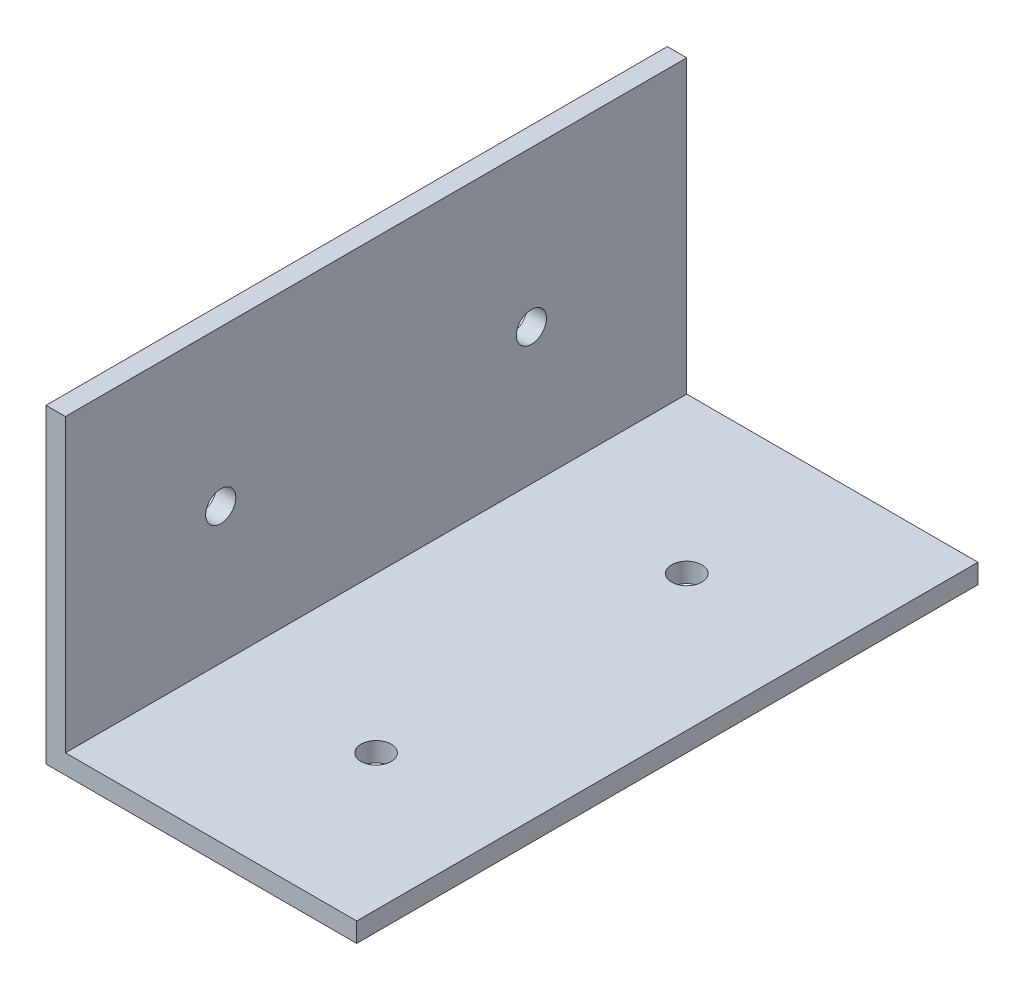
ISO-10303-21;
HEADER;
FILE_DESCRIPTION(('STEP AP214'),'2;1');
FILE_NAME('part.step','',(''),(''),'','','');
FILE_SCHEMA(('AUTOMOTIVE_DESIGN { 1 0 10303 214 1 1 1 1 }'));
ENDSEC;
DATA;
#1=APPLICATION_CONTEXT('core data for automotive mechanical design processes');
#2=APPLICATION_PROTOCOL_DEFINITION('international standard','automotive_design',2000,#1);
#3=PRODUCT_CONTEXT('',#1,'mechanical');
#4=PRODUCT('Part','Part','',(#3));
#5=PRODUCT_RELATED_PRODUCT_CATEGORY('part','',(#4));
#6=PRODUCT_DEFINITION_FORMATION('','',#4);
#7=PRODUCT_DEFINITION_CONTEXT('part definition',#1,'design');
#8=PRODUCT_DEFINITION('design','',#6,#7);
#9=PRODUCT_DEFINITION_SHAPE('','',#8);
#10=(LENGTH_UNIT() NAMED_UNIT(*) SI_UNIT(.MILLI.,.METRE.));
#11=(NAMED_UNIT(*) PLANE_ANGLE_UNIT() SI_UNIT($,.RADIAN.));
#12=(NAMED_UNIT(*) SI_UNIT($,.STERADIAN.) SOLID_ANGLE_UNIT());
#13=UNCERTAINTY_MEASURE_WITH_UNIT(LENGTH_MEASURE(1.E-05),#10,'distance_accuracy_value','');
#14=(GEOMETRIC_REPRESENTATION_CONTEXT(3) GLOBAL_UNCERTAINTY_ASSIGNED_CONTEXT((#13)) GLOBAL_UNIT_ASSIGNED_CONTEXT((#10,
#11,#12)) REPRESENTATION_CONTEXT('',''));
#15=CARTESIAN_POINT('',(0.,0.,0.));
#16=DIRECTION('',(0.,0.,1.));
#17=DIRECTION('',(1.,0.,0.));
#18=AXIS2_PLACEMENT_3D('',#15,#16,#17);
#19=CARTESIAN_POINT('',(0.,0.,101.6));
#20=DIRECTION('',(0.,-1.,0.));
#21=DIRECTION('',(0.,0.,-1.));
#22=AXIS2_PLACEMENT_3D('',#19,#20,#21);
#23=PLANE('',#22);
#24=CARTESIAN_POINT('',(25.4,0.,76.2));
#25=DIRECTION('',(0.,1.,0.));
#26=DIRECTION('',(0.,0.,1.));
#27=AXIS2_PLACEMENT_3D('',#24,#25,#26);
#28=CIRCLE('',#27,2.46379999999999);
#29=CARTESIAN_POINT('',(25.4,0.,78.6638));
#30=VERTEX_POINT('',#29);
#31=EDGE_CURVE('E160',#30,#30,#28,.T.);
#32=ORIENTED_EDGE('',*,*,#31,.F.);
#33=EDGE_LOOP('',(#32));
#34=FACE_BOUND('',#33,.T.);
#35=CARTESIAN_POINT('',(25.4,0.,25.4));
#36=DIRECTION('',(0.,1.,0.));
#37=DIRECTION('',(0.,0.,1.));
#38=AXIS2_PLACEMENT_3D('',#35,#36,#37);
#39=CIRCLE('',#38,2.4638);
#40=CARTESIAN_POINT('',(25.4,0.,27.8638));
#41=VERTEX_POINT('',#40);
#42=EDGE_CURVE('E172',#41,#41,#39,.T.);
#43=ORIENTED_EDGE('',*,*,#42,.F.);
#44=EDGE_LOOP('',(#43));
#45=FACE_BOUND('',#44,.T.);
#46=DIRECTION('',(-1.,0.,0.));
#47=VECTOR('',#46,1.);
#48=CARTESIAN_POINT('',(0.,0.,0.));
#49=LINE('',#48,#47);
#50=CARTESIAN_POINT('',(47.625,0.,0.));
#51=VERTEX_POINT('',#50);
#52=CARTESIAN_POINT('',(0.,0.,0.));
#53=VERTEX_POINT('',#52);
#54=EDGE_CURVE('E129',#51,#53,#49,.T.);
#55=ORIENTED_EDGE('',*,*,#54,.T.);
#56=DIRECTION('',(0.,0.,-1.));
#57=VECTOR('',#56,1.);
#58=CARTESIAN_POINT('',(0.,0.,101.6));
#59=LINE('',#58,#57);
#60=CARTESIAN_POINT('',(0.,0.,101.6));
#61=VERTEX_POINT('',#60);
#62=EDGE_CURVE('E11',#61,#53,#59,.T.);
#63=ORIENTED_EDGE('',*,*,#62,.F.);
#64=DIRECTION('',(-1.,0.,0.));
#65=VECTOR('',#64,1.);
#66=CARTESIAN_POINT('',(0.,0.,101.6));
#67=LINE('',#66,#65);
#68=CARTESIAN_POINT('',(47.625,0.,101.6));
#69=VERTEX_POINT('',#68);
#70=EDGE_CURVE('E146',#69,#61,#67,.T.);
#71=ORIENTED_EDGE('',*,*,#70,.F.);
#72=DIRECTION('',(0.,0.,-1.));
#73=VECTOR('',#72,1.);
#74=CARTESIAN_POINT('',(47.625,0.,101.6));
#75=LINE('',#74,#73);
#76=EDGE_CURVE('E125',#69,#51,#75,.T.);
#77=ORIENTED_EDGE('',*,*,#76,.T.);
#78=EDGE_LOOP('',(#55,#63,#71,#77));
#79=FACE_BOUND('',#78,.T.);
#80=ADVANCED_FACE('F38',(#34,#45,#79),#23,.F.);
#81=CARTESIAN_POINT('',(0.,0.,101.6));
#82=DIRECTION('',(-1.,0.,0.));
#83=DIRECTION('',(0.,0.,1.));
#84=AXIS2_PLACEMENT_3D('',#81,#82,#83);
#85=PLANE('',#84);
#86=CARTESIAN_POINT('',(0.,22.225,25.4));
#87=DIRECTION('',(1.,0.,0.));
#88=DIRECTION('',(0.,0.,-1.));
#89=AXIS2_PLACEMENT_3D('',#86,#87,#88);
#90=CIRCLE('',#89,2.4638);
#91=CARTESIAN_POINT('',(0.,22.225,22.9362));
#92=VERTEX_POINT('',#91);
#93=EDGE_CURVE('E166',#92,#92,#90,.T.);
#94=ORIENTED_EDGE('',*,*,#93,.F.);
#95=EDGE_LOOP('',(#94));
#96=FACE_BOUND('',#95,.T.);
#97=CARTESIAN_POINT('',(0.,22.225,76.2));
#98=DIRECTION('',(1.,0.,0.));
#99=DIRECTION('',(0.,0.,-1.));
#100=AXIS2_PLACEMENT_3D('',#97,#98,#99);
#101=CIRCLE('',#100,2.4638);
#102=CARTESIAN_POINT('',(0.,22.225,73.7362));
#103=VERTEX_POINT('',#102);
#104=EDGE_CURVE('E174',#103,#103,#101,.T.);
#105=ORIENTED_EDGE('',*,*,#104,.F.);
#106=EDGE_LOOP('',(#105));
#107=FACE_BOUND('',#106,.T.);
#108=DIRECTION('',(0.,1.,0.));
#109=VECTOR('',#108,1.);
#110=CARTESIAN_POINT('',(0.,0.,0.));
#111=LINE('',#110,#109);
#112=CARTESIAN_POINT('',(0.,47.625,0.));
#113=VERTEX_POINT('',#112);
#114=EDGE_CURVE('E133',#53,#113,#111,.T.);
#115=ORIENTED_EDGE('',*,*,#114,.T.);
#116=DIRECTION('',(0.,0.,-1.));
#117=VECTOR('',#116,1.);
#118=CARTESIAN_POINT('',(0.,47.625,101.6));
#119=LINE('',#118,#117);
#120=CARTESIAN_POINT('',(0.,47.625,101.6));
#121=VERTEX_POINT('',#120);
#122=EDGE_CURVE('E48',#121,#113,#119,.T.);
#123=ORIENTED_EDGE('',*,*,#122,.F.);
#124=DIRECTION('',(0.,1.,0.));
#125=VECTOR('',#124,1.);
#126=CARTESIAN_POINT('',(0.,0.,101.6));
#127=LINE('',#126,#125);
#128=EDGE_CURVE('E94',#61,#121,#127,.T.);
#129=ORIENTED_EDGE('',*,*,#128,.F.);
#130=ORIENTED_EDGE('',*,*,#62,.T.);
#131=EDGE_LOOP('',(#115,#123,#129,#130));
#132=FACE_BOUND('',#131,.T.);
#133=ADVANCED_FACE('F194',(#96,#107,#132),#85,.F.);
#134=CARTESIAN_POINT('',(0.,47.625,101.6));
#135=DIRECTION('',(0.,-1.,0.));
#136=DIRECTION('',(0.,0.,-1.));
#137=AXIS2_PLACEMENT_3D('',#134,#135,#136);
#138=PLANE('',#137);
#139=DIRECTION('',(-1.,0.,0.));
#140=VECTOR('',#139,1.);
#141=CARTESIAN_POINT('',(0.,47.625,0.));
#142=LINE('',#141,#140);
#143=CARTESIAN_POINT('',(-3.175,47.625,0.));
#144=VERTEX_POINT('',#143);
#145=EDGE_CURVE('E137',#113,#144,#142,.T.);
#146=ORIENTED_EDGE('',*,*,#145,.T.);
#147=DIRECTION('',(0.,0.,-1.));
#148=VECTOR('',#147,1.);
#149=CARTESIAN_POINT('',(-3.175,47.625,101.6));
#150=LINE('',#149,#148);
#151=CARTESIAN_POINT('',(-3.175,47.625,101.6));
#152=VERTEX_POINT('',#151);
#153=EDGE_CURVE('E118',#152,#144,#150,.T.);
#154=ORIENTED_EDGE('',*,*,#153,.F.);
#155=DIRECTION('',(-1.,0.,0.));
#156=VECTOR('',#155,1.);
#157=CARTESIAN_POINT('',(0.,47.625,101.6));
#158=LINE('',#157,#156);
#159=EDGE_CURVE('E107',#121,#152,#158,.T.);
#160=ORIENTED_EDGE('',*,*,#159,.F.);
#161=ORIENTED_EDGE('',*,*,#122,.T.);
#162=EDGE_LOOP('',(#146,#154,#160,#161));
#163=FACE_BOUND('',#162,.T.);
#164=ADVANCED_FACE('F197',(#163),#138,.F.);
#165=CARTESIAN_POINT('',(-3.175,47.625,101.6));
#166=DIRECTION('',(1.,0.,0.));
#167=DIRECTION('',(0.,1.,0.));
#168=AXIS2_PLACEMENT_3D('',#165,#166,#167);
#169=PLANE('',#168);
#170=CARTESIAN_POINT('',(-3.175,22.225,25.4));
#171=DIRECTION('',(1.,0.,0.));
#172=DIRECTION('',(0.,1.,0.));
#173=AXIS2_PLACEMENT_3D('',#170,#171,#172);
#174=CIRCLE('',#173,2.4638);
#175=CARTESIAN_POINT('',(-3.175,24.6888,25.4));
#176=VERTEX_POINT('',#175);
#177=EDGE_CURVE('E41',#176,#176,#174,.T.);
#178=ORIENTED_EDGE('',*,*,#177,.T.);
#179=EDGE_LOOP('',(#178));
#180=FACE_BOUND('',#179,.T.);
#181=CARTESIAN_POINT('',(-3.175,22.225,76.2));
#182=DIRECTION('',(1.,0.,0.));
#183=DIRECTION('',(0.,1.,0.));
#184=AXIS2_PLACEMENT_3D('',#181,#182,#183);
#185=CIRCLE('',#184,2.4638);
#186=CARTESIAN_POINT('',(-3.175,24.6888,76.2));
#187=VERTEX_POINT('',#186);
#188=EDGE_CURVE('E163',#187,#187,#185,.T.);
#189=ORIENTED_EDGE('',*,*,#188,.T.);
#190=EDGE_LOOP('',(#189));
#191=FACE_BOUND('',#190,.T.);
#192=DIRECTION('',(0.,-1.,0.));
#193=VECTOR('',#192,1.);
#194=CARTESIAN_POINT('',(-3.175,47.625,0.));
#195=LINE('',#194,#193);
#196=CARTESIAN_POINT('',(-3.17499999999999,-3.175,0.));
#197=VERTEX_POINT('',#196);
#198=EDGE_CURVE('E116',#144,#197,#195,.T.);
#199=ORIENTED_EDGE('',*,*,#198,.T.);
#200=DIRECTION('',(0.,0.,-1.));
#201=VECTOR('',#200,1.);
#202=CARTESIAN_POINT('',(-3.17499999999999,-3.175,101.6));
#203=LINE('',#202,#201);
#204=CARTESIAN_POINT('',(-3.17499999999999,-3.175,101.6));
#205=VERTEX_POINT('',#204);
#206=EDGE_CURVE('E113',#205,#197,#203,.T.);
#207=ORIENTED_EDGE('',*,*,#206,.F.);
#208=DIRECTION('',(0.,-1.,0.));
#209=VECTOR('',#208,1.);
#210=CARTESIAN_POINT('',(-3.175,47.625,101.6));
#211=LINE('',#210,#209);
#212=EDGE_CURVE('E101',#152,#205,#211,.T.);
#213=ORIENTED_EDGE('',*,*,#212,.F.);
#214=ORIENTED_EDGE('',*,*,#153,.T.);
#215=EDGE_LOOP('',(#199,#207,#213,#214));
#216=FACE_BOUND('',#215,.T.);
#217=ADVANCED_FACE('F114',(#180,#191,#216),#169,.F.);
#218=CARTESIAN_POINT('',(-3.17499999999999,-3.175,101.6));
#219=DIRECTION('',(0.,1.,0.));
#220=DIRECTION('',(0.,0.,1.));
#221=AXIS2_PLACEMENT_3D('',#218,#219,#220);
#222=PLANE('',#221);
#223=CARTESIAN_POINT('',(25.4,-3.175,76.2));
#224=DIRECTION('',(0.,1.,0.));
#225=DIRECTION('',(0.,0.,1.));
#226=AXIS2_PLACEMENT_3D('',#223,#224,#225);
#227=CIRCLE('',#226,2.46379999999999);
#228=CARTESIAN_POINT('',(25.4,-3.175,78.6638));
#229=VERTEX_POINT('',#228);
#230=EDGE_CURVE('E134',#229,#229,#227,.T.);
#231=ORIENTED_EDGE('',*,*,#230,.T.);
#232=EDGE_LOOP('',(#231));
#233=FACE_BOUND('',#232,.T.);
#234=CARTESIAN_POINT('',(25.4,-3.175,25.4));
#235=DIRECTION('',(0.,1.,0.));
#236=DIRECTION('',(0.,0.,1.));
#237=AXIS2_PLACEMENT_3D('',#234,#235,#236);
#238=CIRCLE('',#237,2.4638);
#239=CARTESIAN_POINT('',(25.4,-3.175,27.8638));
#240=VERTEX_POINT('',#239);
#241=EDGE_CURVE('E156',#240,#240,#238,.T.);
#242=ORIENTED_EDGE('',*,*,#241,.T.);
#243=EDGE_LOOP('',(#242));
#244=FACE_BOUND('',#243,.T.);
#245=DIRECTION('',(1.,0.,0.));
#246=VECTOR('',#245,1.);
#247=CARTESIAN_POINT('',(-3.17499999999999,-3.175,0.));
#248=LINE('',#247,#246);
#249=CARTESIAN_POINT('',(47.625,-3.175,0.));
#250=VERTEX_POINT('',#249);
#251=EDGE_CURVE('E80',#197,#250,#248,.T.);
#252=ORIENTED_EDGE('',*,*,#251,.T.);
#253=DIRECTION('',(0.,0.,-1.));
#254=VECTOR('',#253,1.);
#255=CARTESIAN_POINT('',(47.625,-3.175,101.6));
#256=LINE('',#255,#254);
#257=CARTESIAN_POINT('',(47.625,-3.175,101.6));
#258=VERTEX_POINT('',#257);
#259=EDGE_CURVE('E119',#258,#250,#256,.T.);
#260=ORIENTED_EDGE('',*,*,#259,.F.);
#261=DIRECTION('',(1.,0.,0.));
#262=VECTOR('',#261,1.);
#263=CARTESIAN_POINT('',(-3.17499999999999,-3.175,101.6));
#264=LINE('',#263,#262);
#265=EDGE_CURVE('E105',#205,#258,#264,.T.);
#266=ORIENTED_EDGE('',*,*,#265,.F.);
#267=ORIENTED_EDGE('',*,*,#206,.T.);
#268=EDGE_LOOP('',(#252,#260,#266,#267));
#269=FACE_BOUND('',#268,.T.);
#270=ADVANCED_FACE('F121',(#233,#244,#269),#222,.F.);
#271=CARTESIAN_POINT('',(47.625,-3.175,101.6));
#272=DIRECTION('',(-1.,0.,0.));
#273=DIRECTION('',(0.,0.,1.));
#274=AXIS2_PLACEMENT_3D('',#271,#272,#273);
#275=PLANE('',#274);
#276=DIRECTION('',(0.,1.,0.));
#277=VECTOR('',#276,1.);
#278=CARTESIAN_POINT('',(47.625,-3.175,0.));
#279=LINE('',#278,#277);
#280=EDGE_CURVE('E86',#250,#51,#279,.T.);
#281=ORIENTED_EDGE('',*,*,#280,.T.);
#282=ORIENTED_EDGE('',*,*,#76,.F.);
#283=DIRECTION('',(0.,1.,0.));
#284=VECTOR('',#283,1.);
#285=CARTESIAN_POINT('',(47.625,-3.175,101.6));
#286=LINE('',#285,#284);
#287=EDGE_CURVE('E57',#258,#69,#286,.T.);
#288=ORIENTED_EDGE('',*,*,#287,.F.);
#289=ORIENTED_EDGE('',*,*,#259,.T.);
#290=EDGE_LOOP('',(#281,#282,#288,#289));
#291=FACE_BOUND('',#290,.T.);
#292=ADVANCED_FACE('F202',(#291),#275,.F.);
#293=CARTESIAN_POINT('',(0.,0.,101.6));
#294=DIRECTION('',(0.,0.,1.));
#295=DIRECTION('',(1.,0.,0.));
#296=AXIS2_PLACEMENT_3D('',#293,#294,#295);
#297=PLANE('',#296);
#298=ORIENTED_EDGE('',*,*,#70,.T.);
#299=ORIENTED_EDGE('',*,*,#128,.T.);
#300=ORIENTED_EDGE('',*,*,#159,.T.);
#301=ORIENTED_EDGE('',*,*,#212,.T.);
#302=ORIENTED_EDGE('',*,*,#265,.T.);
#303=ORIENTED_EDGE('',*,*,#287,.T.);
#304=EDGE_LOOP('',(#298,#299,#300,#301,#302,#303));
#305=FACE_BOUND('',#304,.T.);
#306=ADVANCED_FACE('F103',(#305),#297,.T.);
#307=CARTESIAN_POINT('',(0.,0.,0.));
#308=DIRECTION('',(0.,0.,1.));
#309=DIRECTION('',(1.,0.,0.));
#310=AXIS2_PLACEMENT_3D('',#307,#308,#309);
#311=PLANE('',#310);
#312=ORIENTED_EDGE('',*,*,#54,.F.);
#313=ORIENTED_EDGE('',*,*,#280,.F.);
#314=ORIENTED_EDGE('',*,*,#251,.F.);
#315=ORIENTED_EDGE('',*,*,#198,.F.);
#316=ORIENTED_EDGE('',*,*,#145,.F.);
#317=ORIENTED_EDGE('',*,*,#114,.F.);
#318=EDGE_LOOP('',(#312,#313,#314,#315,#316,#317));
#319=FACE_BOUND('',#318,.T.);
#320=ADVANCED_FACE('F200',(#319),#311,.F.);
#321=CARTESIAN_POINT('',(25.4,-6.35,25.4));
#322=DIRECTION('',(0.,1.,0.));
#323=DIRECTION('',(0.,0.,1.));
#324=AXIS2_PLACEMENT_3D('',#321,#322,#323);
#325=CYLINDRICAL_SURFACE('',#324,2.4638);
#326=ORIENTED_EDGE('',*,*,#42,.T.);
#327=EDGE_LOOP('',(#326));
#328=FACE_BOUND('',#327,.T.);
#329=ORIENTED_EDGE('',*,*,#241,.F.);
#330=EDGE_LOOP('',(#329));
#331=FACE_BOUND('',#330,.T.);
#332=ADVANCED_FACE('F223',(#328,#331),#325,.F.);
#333=CARTESIAN_POINT('',(25.4,-6.35,76.2));
#334=DIRECTION('',(0.,1.,0.));
#335=DIRECTION('',(0.,0.,1.));
#336=AXIS2_PLACEMENT_3D('',#333,#334,#335);
#337=CYLINDRICAL_SURFACE('',#336,2.46379999999999);
#338=ORIENTED_EDGE('',*,*,#31,.T.);
#339=EDGE_LOOP('',(#338));
#340=FACE_BOUND('',#339,.T.);
#341=ORIENTED_EDGE('',*,*,#230,.F.);
#342=EDGE_LOOP('',(#341));
#343=FACE_BOUND('',#342,.T.);
#344=ADVANCED_FACE('F226',(#340,#343),#337,.F.);
#345=CARTESIAN_POINT('',(-6.35,22.225,76.2));
#346=DIRECTION('',(1.,0.,0.));
#347=DIRECTION('',(0.,0.,-1.));
#348=AXIS2_PLACEMENT_3D('',#345,#346,#347);
#349=CYLINDRICAL_SURFACE('',#348,2.4638);
#350=ORIENTED_EDGE('',*,*,#104,.T.);
#351=EDGE_LOOP('',(#350));
#352=FACE_BOUND('',#351,.T.);
#353=ORIENTED_EDGE('',*,*,#188,.F.);
#354=EDGE_LOOP('',(#353));
#355=FACE_BOUND('',#354,.T.);
#356=ADVANCED_FACE('F234',(#352,#355),#349,.F.);
#357=CARTESIAN_POINT('',(-6.35,22.225,25.4));
#358=DIRECTION('',(1.,0.,0.));
#359=DIRECTION('',(0.,0.,-1.));
#360=AXIS2_PLACEMENT_3D('',#357,#358,#359);
#361=CYLINDRICAL_SURFACE('',#360,2.4638);
#362=ORIENTED_EDGE('',*,*,#93,.T.);
#363=EDGE_LOOP('',(#362));
#364=FACE_BOUND('',#363,.T.);
#365=ORIENTED_EDGE('',*,*,#177,.F.);
#366=EDGE_LOOP('',(#365));
#367=FACE_BOUND('',#366,.T.);
#368=ADVANCED_FACE('F240',(#364,#367),#361,.F.);
#369=CLOSED_SHELL('',(#80,#133,#164,#217,#270,#292,#306,#320,#332,#344,#356,#368));
#370=MANIFOLD_SOLID_BREP('B2',#369);
#371=ADVANCED_BREP_SHAPE_REPRESENTATION('',(#18,#370),#14);
#372=SHAPE_DEFINITION_REPRESENTATION(#9,#371);
ENDSEC;
END-ISO-10303-21;
